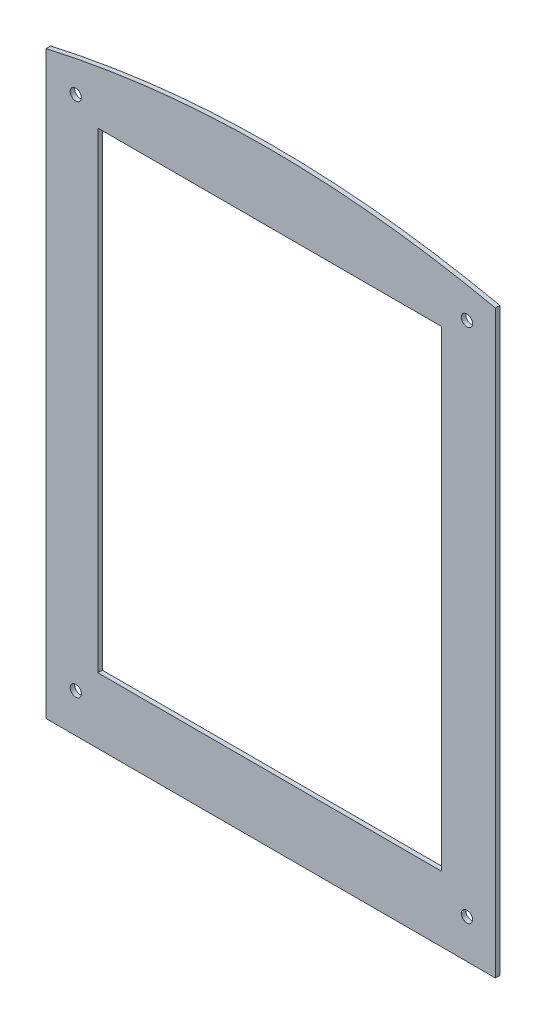
ISO-10303-21;
HEADER;
FILE_DESCRIPTION(('STEP AP214'),'2;1');
FILE_NAME('part.step','',(''),(''),'','','');
FILE_SCHEMA(('AUTOMOTIVE_DESIGN { 1 0 10303 214 1 1 1 1 }'));
ENDSEC;
DATA;
#1=APPLICATION_CONTEXT('core data for automotive mechanical design processes');
#2=APPLICATION_PROTOCOL_DEFINITION('international standard','automotive_design',2000,#1);
#3=PRODUCT_CONTEXT('',#1,'mechanical');
#4=PRODUCT('Part','Part','',(#3));
#5=PRODUCT_RELATED_PRODUCT_CATEGORY('part','',(#4));
#6=PRODUCT_DEFINITION_FORMATION('','',#4);
#7=PRODUCT_DEFINITION_CONTEXT('part definition',#1,'design');
#8=PRODUCT_DEFINITION('design','',#6,#7);
#9=PRODUCT_DEFINITION_SHAPE('','',#8);
#10=(LENGTH_UNIT() NAMED_UNIT(*) SI_UNIT(.MILLI.,.METRE.));
#11=(NAMED_UNIT(*) PLANE_ANGLE_UNIT() SI_UNIT($,.RADIAN.));
#12=(NAMED_UNIT(*) SI_UNIT($,.STERADIAN.) SOLID_ANGLE_UNIT());
#13=UNCERTAINTY_MEASURE_WITH_UNIT(LENGTH_MEASURE(1.E-05),#10,'distance_accuracy_value','');
#14=(GEOMETRIC_REPRESENTATION_CONTEXT(3) GLOBAL_UNCERTAINTY_ASSIGNED_CONTEXT((#13)) GLOBAL_UNIT_ASSIGNED_CONTEXT((#10,
#11,#12)) REPRESENTATION_CONTEXT('',''));
#15=CARTESIAN_POINT('',(0.,0.,0.));
#16=DIRECTION('',(0.,0.,1.));
#17=DIRECTION('',(1.,0.,0.));
#18=AXIS2_PLACEMENT_3D('',#15,#16,#17);
#19=CARTESIAN_POINT('',(-21.2524165004895,269.375495234016,2.));
#20=DIRECTION('',(0.,0.,1.));
#21=DIRECTION('',(1.,0.,0.));
#22=AXIS2_PLACEMENT_3D('',#19,#20,#21);
#23=PLANE('',#22);
#24=CARTESIAN_POINT('',(67.3224541716038,17.3421995430036,2.));
#25=DIRECTION('',(0.,0.,1.));
#26=DIRECTION('',(1.,0.,0.));
#27=AXIS2_PLACEMENT_3D('',#24,#25,#26);
#28=CIRCLE('',#27,2.5);
#29=CARTESIAN_POINT('',(69.8224541716038,17.3421995430036,2.));
#30=VERTEX_POINT('',#29);
#31=EDGE_CURVE('E213',#30,#30,#28,.T.);
#32=ORIENTED_EDGE('',*,*,#31,.F.);
#33=EDGE_LOOP('',(#32));
#34=FACE_BOUND('',#33,.T.);
#35=CARTESIAN_POINT('',(-106.80366991365,247.177426870696,2.));
#36=DIRECTION('',(0.,0.,1.));
#37=DIRECTION('',(1.,0.,0.));
#38=AXIS2_PLACEMENT_3D('',#35,#36,#37);
#39=CIRCLE('',#38,2.5);
#40=CARTESIAN_POINT('',(-104.30366991365,247.177426870696,2.));
#41=VERTEX_POINT('',#40);
#42=EDGE_CURVE('E130',#41,#41,#39,.T.);
#43=ORIENTED_EDGE('',*,*,#42,.F.);
#44=EDGE_LOOP('',(#43));
#45=FACE_BOUND('',#44,.T.);
#46=DIRECTION('',(0.,1.,0.));
#47=VECTOR('',#46,1.);
#48=CARTESIAN_POINT('',(79.9896774193548,258.3,2.));
#49=LINE('',#48,#47);
#50=CARTESIAN_POINT('',(79.9896774193548,0.,2.));
#51=VERTEX_POINT('',#50);
#52=CARTESIAN_POINT('',(79.9896774193548,258.3,2.));
#53=VERTEX_POINT('',#52);
#54=EDGE_CURVE('E140',#51,#53,#49,.T.);
#55=ORIENTED_EDGE('',*,*,#54,.T.);
#56=CARTESIAN_POINT('',(79.9896774193548,258.3,2.));
#57=CARTESIAN_POINT('',(-22.4945104203337,280.450990468032,2.));
#58=CARTESIAN_POINT('',(-120.010322580645,258.3,2.));
#59=B_SPLINE_CURVE_WITH_KNOTS('',2,(#56,#57,#58),.UNSPECIFIED.,.F.,.F.,(3,3),(0.,1.),.UNSPECIFIED.);
#60=CARTESIAN_POINT('',(-120.010322580645,258.3,2.));
#61=VERTEX_POINT('',#60);
#62=EDGE_CURVE('E143',#53,#61,#59,.T.);
#63=ORIENTED_EDGE('',*,*,#62,.T.);
#64=DIRECTION('',(0.,-1.,0.));
#65=VECTOR('',#64,1.);
#66=CARTESIAN_POINT('',(-120.010322580645,0.,2.));
#67=LINE('',#66,#65);
#68=CARTESIAN_POINT('',(-120.010322580645,0.,2.));
#69=VERTEX_POINT('',#68);
#70=EDGE_CURVE('E149',#61,#69,#67,.T.);
#71=ORIENTED_EDGE('',*,*,#70,.T.);
#72=DIRECTION('',(1.,0.,0.));
#73=VECTOR('',#72,1.);
#74=CARTESIAN_POINT('',(79.9896774193548,0.,2.));
#75=LINE('',#74,#73);
#76=EDGE_CURVE('E243',#69,#51,#75,.T.);
#77=ORIENTED_EDGE('',*,*,#76,.T.);
#78=EDGE_LOOP('',(#55,#63,#71,#77));
#79=FACE_BOUND('',#78,.T.);
#80=DIRECTION('',(-1.,0.,0.));
#81=VECTOR('',#80,1.);
#82=CARTESIAN_POINT('',(55.9970946775829,239.178843816006,2.));
#83=LINE('',#82,#81);
#84=CARTESIAN_POINT('',(55.9970946775829,239.178843816006,2.));
#85=VERTEX_POINT('',#84);
#86=CARTESIAN_POINT('',(-97.0029053224171,239.178843816006,2.));
#87=VERTEX_POINT('',#86);
#88=EDGE_CURVE('E109',#85,#87,#83,.T.);
#89=ORIENTED_EDGE('',*,*,#88,.F.);
#90=DIRECTION('',(0.,1.,0.));
#91=VECTOR('',#90,1.);
#92=CARTESIAN_POINT('',(55.9970946775829,239.178843816006,2.));
#93=LINE('',#92,#91);
#94=CARTESIAN_POINT('',(55.9970946775829,29.1788438160064,2.));
#95=VERTEX_POINT('',#94);
#96=EDGE_CURVE('E101',#95,#85,#93,.T.);
#97=ORIENTED_EDGE('',*,*,#96,.F.);
#98=DIRECTION('',(1.,0.,0.));
#99=VECTOR('',#98,1.);
#100=CARTESIAN_POINT('',(55.9970946775829,29.1788438160064,2.));
#101=LINE('',#100,#99);
#102=CARTESIAN_POINT('',(-97.0029053224171,29.1788438160064,2.));
#103=VERTEX_POINT('',#102);
#104=EDGE_CURVE('E124',#103,#95,#101,.T.);
#105=ORIENTED_EDGE('',*,*,#104,.F.);
#106=DIRECTION('',(0.,-1.,0.));
#107=VECTOR('',#106,1.);
#108=CARTESIAN_POINT('',(-97.0029053224171,239.178843816006,2.));
#109=LINE('',#108,#107);
#110=EDGE_CURVE('E122',#87,#103,#109,.T.);
#111=ORIENTED_EDGE('',*,*,#110,.F.);
#112=EDGE_LOOP('',(#89,#97,#105,#111));
#113=FACE_BOUND('',#112,.T.);
#114=CARTESIAN_POINT('',(67.3224541716038,247.177426870696,2.));
#115=DIRECTION('',(0.,0.,1.));
#116=DIRECTION('',(1.,0.,0.));
#117=AXIS2_PLACEMENT_3D('',#114,#115,#116);
#118=CIRCLE('',#117,2.5);
#119=CARTESIAN_POINT('',(69.8224541716038,247.177426870696,2.));
#120=VERTEX_POINT('',#119);
#121=EDGE_CURVE('E219',#120,#120,#118,.T.);
#122=ORIENTED_EDGE('',*,*,#121,.F.);
#123=EDGE_LOOP('',(#122));
#124=FACE_BOUND('',#123,.T.);
#125=CARTESIAN_POINT('',(-106.80366991365,17.3421995430036,2.));
#126=DIRECTION('',(0.,0.,1.));
#127=DIRECTION('',(1.,0.,0.));
#128=AXIS2_PLACEMENT_3D('',#125,#126,#127);
#129=CIRCLE('',#128,2.5);
#130=CARTESIAN_POINT('',(-104.30366991365,17.3421995430036,2.));
#131=VERTEX_POINT('',#130);
#132=EDGE_CURVE('E204',#131,#131,#129,.T.);
#133=ORIENTED_EDGE('',*,*,#132,.F.);
#134=EDGE_LOOP('',(#133));
#135=FACE_BOUND('',#134,.T.);
#136=ADVANCED_FACE('F36',(#34,#45,#79,#113,#124,#135),#23,.T.);
#137=CARTESIAN_POINT('',(-21.2524165004895,269.375495234016,0.));
#138=DIRECTION('',(0.,0.,1.));
#139=DIRECTION('',(1.,0.,0.));
#140=AXIS2_PLACEMENT_3D('',#137,#138,#139);
#141=PLANE('',#140);
#142=DIRECTION('',(0.,1.,0.));
#143=VECTOR('',#142,1.);
#144=CARTESIAN_POINT('',(79.9896774193548,258.3,0.));
#145=LINE('',#144,#143);
#146=CARTESIAN_POINT('',(79.9896774193548,0.,0.));
#147=VERTEX_POINT('',#146);
#148=CARTESIAN_POINT('',(79.9896774193548,258.3,0.));
#149=VERTEX_POINT('',#148);
#150=EDGE_CURVE('E117',#147,#149,#145,.T.);
#151=ORIENTED_EDGE('',*,*,#150,.F.);
#152=DIRECTION('',(1.,0.,0.));
#153=VECTOR('',#152,1.);
#154=CARTESIAN_POINT('',(79.9896774193548,0.,0.));
#155=LINE('',#154,#153);
#156=CARTESIAN_POINT('',(-120.010322580645,0.,0.));
#157=VERTEX_POINT('',#156);
#158=EDGE_CURVE('E144',#157,#147,#155,.T.);
#159=ORIENTED_EDGE('',*,*,#158,.F.);
#160=DIRECTION('',(0.,-1.,0.));
#161=VECTOR('',#160,1.);
#162=CARTESIAN_POINT('',(-120.010322580645,0.,0.));
#163=LINE('',#162,#161);
#164=CARTESIAN_POINT('',(-120.010322580645,258.3,0.));
#165=VERTEX_POINT('',#164);
#166=EDGE_CURVE('E263',#165,#157,#163,.T.);
#167=ORIENTED_EDGE('',*,*,#166,.F.);
#168=CARTESIAN_POINT('',(79.9896774193548,258.3,0.));
#169=CARTESIAN_POINT('',(-22.4945104203337,280.450990468032,0.));
#170=CARTESIAN_POINT('',(-120.010322580645,258.3,0.));
#171=B_SPLINE_CURVE_WITH_KNOTS('',2,(#168,#169,#170),.UNSPECIFIED.,.F.,.F.,(3,3),(0.,1.),.UNSPECIFIED.);
#172=EDGE_CURVE('E249',#149,#165,#171,.T.);
#173=ORIENTED_EDGE('',*,*,#172,.F.);
#174=EDGE_LOOP('',(#151,#159,#167,#173));
#175=FACE_BOUND('',#174,.T.);
#176=DIRECTION('',(0.,1.,0.));
#177=VECTOR('',#176,1.);
#178=CARTESIAN_POINT('',(55.9970946775829,239.178843816006,0.));
#179=LINE('',#178,#177);
#180=CARTESIAN_POINT('',(55.9970946775829,29.1788438160064,0.));
#181=VERTEX_POINT('',#180);
#182=CARTESIAN_POINT('',(55.9970946775829,239.178843816006,0.));
#183=VERTEX_POINT('',#182);
#184=EDGE_CURVE('E59',#181,#183,#179,.T.);
#185=ORIENTED_EDGE('',*,*,#184,.T.);
#186=DIRECTION('',(-1.,0.,0.));
#187=VECTOR('',#186,1.);
#188=CARTESIAN_POINT('',(55.9970946775829,239.178843816006,0.));
#189=LINE('',#188,#187);
#190=CARTESIAN_POINT('',(-97.0029053224171,239.178843816006,0.));
#191=VERTEX_POINT('',#190);
#192=EDGE_CURVE('E116',#183,#191,#189,.T.);
#193=ORIENTED_EDGE('',*,*,#192,.T.);
#194=DIRECTION('',(0.,-1.,0.));
#195=VECTOR('',#194,1.);
#196=CARTESIAN_POINT('',(-97.0029053224171,239.178843816006,0.));
#197=LINE('',#196,#195);
#198=CARTESIAN_POINT('',(-97.0029053224171,29.1788438160064,0.));
#199=VERTEX_POINT('',#198);
#200=EDGE_CURVE('E132',#191,#199,#197,.T.);
#201=ORIENTED_EDGE('',*,*,#200,.T.);
#202=DIRECTION('',(1.,0.,0.));
#203=VECTOR('',#202,1.);
#204=CARTESIAN_POINT('',(55.9970946775829,29.1788438160064,0.));
#205=LINE('',#204,#203);
#206=EDGE_CURVE('E110',#199,#181,#205,.T.);
#207=ORIENTED_EDGE('',*,*,#206,.T.);
#208=EDGE_LOOP('',(#185,#193,#201,#207));
#209=FACE_BOUND('',#208,.T.);
#210=CARTESIAN_POINT('',(-106.80366991365,247.177426870696,0.));
#211=DIRECTION('',(0.,0.,1.));
#212=DIRECTION('',(1.,0.,0.));
#213=AXIS2_PLACEMENT_3D('',#210,#211,#212);
#214=CIRCLE('',#213,2.5);
#215=CARTESIAN_POINT('',(-104.30366991365,247.177426870696,0.));
#216=VERTEX_POINT('',#215);
#217=EDGE_CURVE('E222',#216,#216,#214,.T.);
#218=ORIENTED_EDGE('',*,*,#217,.T.);
#219=EDGE_LOOP('',(#218));
#220=FACE_BOUND('',#219,.T.);
#221=CARTESIAN_POINT('',(67.3224541716038,247.177426870696,0.));
#222=DIRECTION('',(0.,0.,1.));
#223=DIRECTION('',(1.,0.,0.));
#224=AXIS2_PLACEMENT_3D('',#221,#222,#223);
#225=CIRCLE('',#224,2.5);
#226=CARTESIAN_POINT('',(69.8224541716038,247.177426870696,0.));
#227=VERTEX_POINT('',#226);
#228=EDGE_CURVE('E216',#227,#227,#225,.T.);
#229=ORIENTED_EDGE('',*,*,#228,.T.);
#230=EDGE_LOOP('',(#229));
#231=FACE_BOUND('',#230,.T.);
#232=CARTESIAN_POINT('',(67.3224541716038,17.3421995430036,0.));
#233=DIRECTION('',(0.,0.,1.));
#234=DIRECTION('',(1.,0.,0.));
#235=AXIS2_PLACEMENT_3D('',#232,#233,#234);
#236=CIRCLE('',#235,2.5);
#237=CARTESIAN_POINT('',(69.8224541716038,17.3421995430036,0.));
#238=VERTEX_POINT('',#237);
#239=EDGE_CURVE('E210',#238,#238,#236,.T.);
#240=ORIENTED_EDGE('',*,*,#239,.T.);
#241=EDGE_LOOP('',(#240));
#242=FACE_BOUND('',#241,.T.);
#243=CARTESIAN_POINT('',(-106.80366991365,17.3421995430036,0.));
#244=DIRECTION('',(0.,0.,1.));
#245=DIRECTION('',(1.,0.,0.));
#246=AXIS2_PLACEMENT_3D('',#243,#244,#245);
#247=CIRCLE('',#246,2.5);
#248=CARTESIAN_POINT('',(-104.30366991365,17.3421995430036,0.));
#249=VERTEX_POINT('',#248);
#250=EDGE_CURVE('E207',#249,#249,#247,.T.);
#251=ORIENTED_EDGE('',*,*,#250,.T.);
#252=EDGE_LOOP('',(#251));
#253=FACE_BOUND('',#252,.T.);
#254=ADVANCED_FACE('F166',(#175,#209,#220,#231,#242,#253),#141,.F.);
#255=CARTESIAN_POINT('',(79.9896774193548,258.3,2.));
#256=DIRECTION('',(-1.,0.,0.));
#257=DIRECTION('',(0.,0.,1.));
#258=AXIS2_PLACEMENT_3D('',#255,#256,#257);
#259=PLANE('',#258);
#260=ORIENTED_EDGE('',*,*,#150,.T.);
#261=DIRECTION('',(0.,0.,-1.));
#262=VECTOR('',#261,1.);
#263=CARTESIAN_POINT('',(79.9896774193548,258.3,2.));
#264=LINE('',#263,#262);
#265=EDGE_CURVE('E11',#53,#149,#264,.T.);
#266=ORIENTED_EDGE('',*,*,#265,.F.);
#267=ORIENTED_EDGE('',*,*,#54,.F.);
#268=DIRECTION('',(0.,0.,-1.));
#269=VECTOR('',#268,1.);
#270=CARTESIAN_POINT('',(79.9896774193548,0.,2.));
#271=LINE('',#270,#269);
#272=EDGE_CURVE('E256',#51,#147,#271,.T.);
#273=ORIENTED_EDGE('',*,*,#272,.T.);
#274=EDGE_LOOP('',(#260,#266,#267,#273));
#275=FACE_BOUND('',#274,.T.);
#276=ADVANCED_FACE('F38',(#275),#259,.F.);
#277=DIRECTION('',(0.,0.,-1.));
#278=VECTOR('',#277,1.);
#279=SURFACE_OF_LINEAR_EXTRUSION('',#59,#278);
#280=ORIENTED_EDGE('',*,*,#172,.T.);
#281=DIRECTION('',(0.,0.,-1.));
#282=VECTOR('',#281,1.);
#283=CARTESIAN_POINT('',(-120.010322580645,258.3,2.));
#284=LINE('',#283,#282);
#285=EDGE_CURVE('E44',#61,#165,#284,.T.);
#286=ORIENTED_EDGE('',*,*,#285,.F.);
#287=ORIENTED_EDGE('',*,*,#62,.F.);
#288=ORIENTED_EDGE('',*,*,#265,.T.);
#289=EDGE_LOOP('',(#280,#286,#287,#288));
#290=FACE_BOUND('',#289,.T.);
#291=ADVANCED_FACE('F154',(#290),#279,.F.);
#292=CARTESIAN_POINT('',(-120.010322580645,0.,2.));
#293=DIRECTION('',(1.,0.,0.));
#294=DIRECTION('',(0.,0.,-1.));
#295=AXIS2_PLACEMENT_3D('',#292,#293,#294);
#296=PLANE('',#295);
#297=ORIENTED_EDGE('',*,*,#166,.T.);
#298=DIRECTION('',(0.,0.,-1.));
#299=VECTOR('',#298,1.);
#300=CARTESIAN_POINT('',(-120.010322580645,0.,2.));
#301=LINE('',#300,#299);
#302=EDGE_CURVE('E253',#69,#157,#301,.T.);
#303=ORIENTED_EDGE('',*,*,#302,.F.);
#304=ORIENTED_EDGE('',*,*,#70,.F.);
#305=ORIENTED_EDGE('',*,*,#285,.T.);
#306=EDGE_LOOP('',(#297,#303,#304,#305));
#307=FACE_BOUND('',#306,.T.);
#308=ADVANCED_FACE('F157',(#307),#296,.F.);
#309=CARTESIAN_POINT('',(79.9896774193548,0.,2.));
#310=DIRECTION('',(0.,1.,0.));
#311=DIRECTION('',(-1.,0.,0.));
#312=AXIS2_PLACEMENT_3D('',#309,#310,#311);
#313=PLANE('',#312);
#314=ORIENTED_EDGE('',*,*,#158,.T.);
#315=ORIENTED_EDGE('',*,*,#272,.F.);
#316=ORIENTED_EDGE('',*,*,#76,.F.);
#317=ORIENTED_EDGE('',*,*,#302,.T.);
#318=EDGE_LOOP('',(#314,#315,#316,#317));
#319=FACE_BOUND('',#318,.T.);
#320=ADVANCED_FACE('F161',(#319),#313,.F.);
#321=CARTESIAN_POINT('',(55.9970946775829,239.178843816006,2.));
#322=DIRECTION('',(-1.,0.,0.));
#323=DIRECTION('',(0.,-1.,0.));
#324=AXIS2_PLACEMENT_3D('',#321,#322,#323);
#325=PLANE('',#324);
#326=ORIENTED_EDGE('',*,*,#184,.F.);
#327=DIRECTION('',(0.,0.,-1.));
#328=VECTOR('',#327,1.);
#329=CARTESIAN_POINT('',(55.9970946775829,29.1788438160064,2.));
#330=LINE('',#329,#328);
#331=EDGE_CURVE('E105',#95,#181,#330,.T.);
#332=ORIENTED_EDGE('',*,*,#331,.F.);
#333=ORIENTED_EDGE('',*,*,#96,.T.);
#334=DIRECTION('',(0.,0.,-1.));
#335=VECTOR('',#334,1.);
#336=CARTESIAN_POINT('',(55.9970946775829,239.178843816006,2.));
#337=LINE('',#336,#335);
#338=EDGE_CURVE('E104',#85,#183,#337,.T.);
#339=ORIENTED_EDGE('',*,*,#338,.T.);
#340=EDGE_LOOP('',(#326,#332,#333,#339));
#341=FACE_BOUND('',#340,.T.);
#342=ADVANCED_FACE('F103',(#341),#325,.T.);
#343=CARTESIAN_POINT('',(55.9970946775829,239.178843816006,2.));
#344=DIRECTION('',(0.,-1.,0.));
#345=DIRECTION('',(0.,0.,-1.));
#346=AXIS2_PLACEMENT_3D('',#343,#344,#345);
#347=PLANE('',#346);
#348=ORIENTED_EDGE('',*,*,#192,.F.);
#349=ORIENTED_EDGE('',*,*,#338,.F.);
#350=ORIENTED_EDGE('',*,*,#88,.T.);
#351=DIRECTION('',(0.,0.,-1.));
#352=VECTOR('',#351,1.);
#353=CARTESIAN_POINT('',(-97.0029053224171,239.178843816006,2.));
#354=LINE('',#353,#352);
#355=EDGE_CURVE('E118',#87,#191,#354,.T.);
#356=ORIENTED_EDGE('',*,*,#355,.T.);
#357=EDGE_LOOP('',(#348,#349,#350,#356));
#358=FACE_BOUND('',#357,.T.);
#359=ADVANCED_FACE('F113',(#358),#347,.T.);
#360=CARTESIAN_POINT('',(-97.0029053224171,239.178843816006,2.));
#361=DIRECTION('',(1.,0.,0.));
#362=DIRECTION('',(0.,1.,0.));
#363=AXIS2_PLACEMENT_3D('',#360,#361,#362);
#364=PLANE('',#363);
#365=ORIENTED_EDGE('',*,*,#200,.F.);
#366=ORIENTED_EDGE('',*,*,#355,.F.);
#367=ORIENTED_EDGE('',*,*,#110,.T.);
#368=DIRECTION('',(0.,0.,-1.));
#369=VECTOR('',#368,1.);
#370=CARTESIAN_POINT('',(-97.0029053224171,29.1788438160064,2.));
#371=LINE('',#370,#369);
#372=EDGE_CURVE('E51',#103,#199,#371,.T.);
#373=ORIENTED_EDGE('',*,*,#372,.T.);
#374=EDGE_LOOP('',(#365,#366,#367,#373));
#375=FACE_BOUND('',#374,.T.);
#376=ADVANCED_FACE('F177',(#375),#364,.T.);
#377=CARTESIAN_POINT('',(55.9970946775829,29.1788438160064,2.));
#378=DIRECTION('',(0.,1.,0.));
#379=DIRECTION('',(-1.,0.,0.));
#380=AXIS2_PLACEMENT_3D('',#377,#378,#379);
#381=PLANE('',#380);
#382=ORIENTED_EDGE('',*,*,#206,.F.);
#383=ORIENTED_EDGE('',*,*,#372,.F.);
#384=ORIENTED_EDGE('',*,*,#104,.T.);
#385=ORIENTED_EDGE('',*,*,#331,.T.);
#386=EDGE_LOOP('',(#382,#383,#384,#385));
#387=FACE_BOUND('',#386,.T.);
#388=ADVANCED_FACE('F180',(#387),#381,.T.);
#389=CARTESIAN_POINT('',(-106.80366991365,247.177426870696,2.));
#390=DIRECTION('',(0.,0.,-1.));
#391=DIRECTION('',(-1.,0.,0.));
#392=AXIS2_PLACEMENT_3D('',#389,#390,#391);
#393=CYLINDRICAL_SURFACE('',#392,2.5);
#394=ORIENTED_EDGE('',*,*,#42,.T.);
#395=EDGE_LOOP('',(#394));
#396=FACE_BOUND('',#395,.T.);
#397=ORIENTED_EDGE('',*,*,#217,.F.);
#398=EDGE_LOOP('',(#397));
#399=FACE_BOUND('',#398,.T.);
#400=ADVANCED_FACE('F184',(#396,#399),#393,.F.);
#401=CARTESIAN_POINT('',(67.3224541716038,247.177426870696,2.));
#402=DIRECTION('',(0.,0.,-1.));
#403=DIRECTION('',(-1.,0.,0.));
#404=AXIS2_PLACEMENT_3D('',#401,#402,#403);
#405=CYLINDRICAL_SURFACE('',#404,2.5);
#406=ORIENTED_EDGE('',*,*,#121,.T.);
#407=EDGE_LOOP('',(#406));
#408=FACE_BOUND('',#407,.T.);
#409=ORIENTED_EDGE('',*,*,#228,.F.);
#410=EDGE_LOOP('',(#409));
#411=FACE_BOUND('',#410,.T.);
#412=ADVANCED_FACE('F187',(#408,#411),#405,.F.);
#413=CARTESIAN_POINT('',(67.3224541716038,17.3421995430036,2.));
#414=DIRECTION('',(0.,0.,-1.));
#415=DIRECTION('',(-1.,0.,0.));
#416=AXIS2_PLACEMENT_3D('',#413,#414,#415);
#417=CYLINDRICAL_SURFACE('',#416,2.5);
#418=ORIENTED_EDGE('',*,*,#31,.T.);
#419=EDGE_LOOP('',(#418));
#420=FACE_BOUND('',#419,.T.);
#421=ORIENTED_EDGE('',*,*,#239,.F.);
#422=EDGE_LOOP('',(#421));
#423=FACE_BOUND('',#422,.T.);
#424=ADVANCED_FACE('F191',(#420,#423),#417,.F.);
#425=CARTESIAN_POINT('',(-106.80366991365,17.3421995430036,2.));
#426=DIRECTION('',(0.,0.,-1.));
#427=DIRECTION('',(-1.,0.,0.));
#428=AXIS2_PLACEMENT_3D('',#425,#426,#427);
#429=CYLINDRICAL_SURFACE('',#428,2.5);
#430=ORIENTED_EDGE('',*,*,#132,.T.);
#431=EDGE_LOOP('',(#430));
#432=FACE_BOUND('',#431,.T.);
#433=ORIENTED_EDGE('',*,*,#250,.F.);
#434=EDGE_LOOP('',(#433));
#435=FACE_BOUND('',#434,.T.);
#436=ADVANCED_FACE('F195',(#432,#435),#429,.F.);
#437=CLOSED_SHELL('',(#136,#254,#276,#291,#308,#320,#342,#359,#376,#388,#400,#412,#424,#436));
#438=MANIFOLD_SOLID_BREP('B2',#437);
#439=ADVANCED_BREP_SHAPE_REPRESENTATION('',(#18,#438),#14);
#440=SHAPE_DEFINITION_REPRESENTATION(#9,#439);
ENDSEC;
END-ISO-10303-21;
